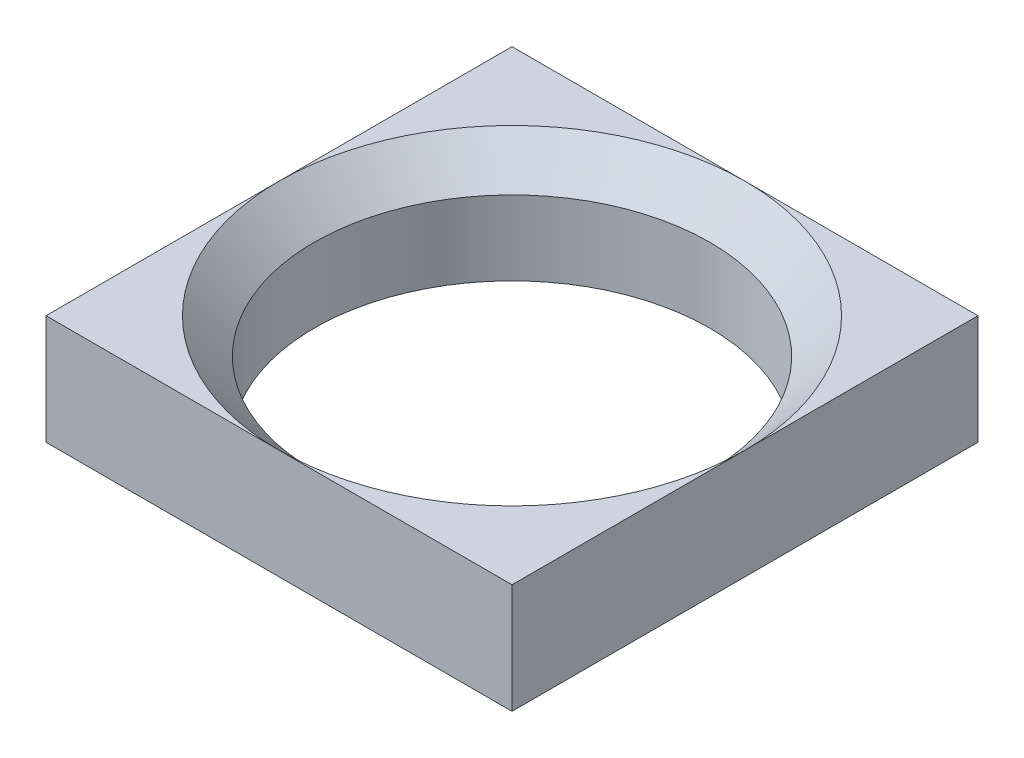
ISO-10303-21;
HEADER;
FILE_DESCRIPTION(('STEP AP214'),'2;1');
FILE_NAME('part.step','',(''),(''),'','','');
FILE_SCHEMA(('AUTOMOTIVE_DESIGN { 1 0 10303 214 1 1 1 1 }'));
ENDSEC;
DATA;
#1=APPLICATION_CONTEXT('core data for automotive mechanical design processes');
#2=APPLICATION_PROTOCOL_DEFINITION('international standard','automotive_design',2000,#1);
#3=PRODUCT_CONTEXT('',#1,'mechanical');
#4=PRODUCT('Part','Part','',(#3));
#5=PRODUCT_RELATED_PRODUCT_CATEGORY('part','',(#4));
#6=PRODUCT_DEFINITION_FORMATION('','',#4);
#7=PRODUCT_DEFINITION_CONTEXT('part definition',#1,'design');
#8=PRODUCT_DEFINITION('design','',#6,#7);
#9=PRODUCT_DEFINITION_SHAPE('','',#8);
#10=(LENGTH_UNIT() NAMED_UNIT(*) SI_UNIT(.MILLI.,.METRE.));
#11=(NAMED_UNIT(*) PLANE_ANGLE_UNIT() SI_UNIT($,.RADIAN.));
#12=(NAMED_UNIT(*) SI_UNIT($,.STERADIAN.) SOLID_ANGLE_UNIT());
#13=UNCERTAINTY_MEASURE_WITH_UNIT(LENGTH_MEASURE(1.E-05),#10,'distance_accuracy_value','');
#14=(GEOMETRIC_REPRESENTATION_CONTEXT(3) GLOBAL_UNCERTAINTY_ASSIGNED_CONTEXT((#13)) GLOBAL_UNIT_ASSIGNED_CONTEXT((#10,
#11,#12)) REPRESENTATION_CONTEXT('',''));
#15=CARTESIAN_POINT('',(0.,0.,0.));
#16=DIRECTION('',(0.,0.,1.));
#17=DIRECTION('',(1.,0.,0.));
#18=AXIS2_PLACEMENT_3D('',#15,#16,#17);
#19=CARTESIAN_POINT('',(0.,2.8,0.));
#20=DIRECTION('',(0.,1.,0.));
#21=DIRECTION('',(0.,0.,1.));
#22=AXIS2_PLACEMENT_3D('',#19,#20,#21);
#23=PLANE('',#22);
#24=DIRECTION('',(1.,0.,0.));
#25=VECTOR('',#24,1.);
#26=CARTESIAN_POINT('',(-5.95,2.8,5.95));
#27=LINE('',#26,#25);
#28=CARTESIAN_POINT('',(-5.95,2.8,5.95));
#29=VERTEX_POINT('',#28);
#30=CARTESIAN_POINT('',(0.,2.8,5.95));
#31=VERTEX_POINT('',#30);
#32=EDGE_CURVE('E139',#29,#31,#27,.T.);
#33=ORIENTED_EDGE('',*,*,#32,.T.);
#34=CARTESIAN_POINT('',(0.,2.8,0.));
#35=DIRECTION('',(0.,1.,0.));
#36=DIRECTION('',(0.,0.,1.));
#37=AXIS2_PLACEMENT_3D('',#34,#35,#36);
#38=CIRCLE('',#37,5.95000000000001);
#39=CARTESIAN_POINT('',(-5.95,2.8,0.));
#40=VERTEX_POINT('',#39);
#41=EDGE_CURVE('E11',#31,#40,#38,.F.);
#42=ORIENTED_EDGE('',*,*,#41,.T.);
#43=DIRECTION('',(0.,0.,1.));
#44=VECTOR('',#43,1.);
#45=CARTESIAN_POINT('',(-5.95,2.8,-5.95));
#46=LINE('',#45,#44);
#47=EDGE_CURVE('E113',#40,#29,#46,.T.);
#48=ORIENTED_EDGE('',*,*,#47,.T.);
#49=EDGE_LOOP('',(#33,#42,#48));
#50=FACE_BOUND('',#49,.T.);
#51=ADVANCED_FACE('F40',(#50),#23,.T.);
#52=CARTESIAN_POINT('',(-5.95,2.8,-5.95));
#53=VERTEX_POINT('',#52);
#54=EDGE_CURVE('E134',#53,#40,#46,.T.);
#55=ORIENTED_EDGE('',*,*,#54,.T.);
#56=CARTESIAN_POINT('',(0.,2.8,0.));
#57=DIRECTION('',(0.,1.,0.));
#58=DIRECTION('',(0.,0.,1.));
#59=AXIS2_PLACEMENT_3D('',#56,#57,#58);
#60=CIRCLE('',#59,5.95000000000001);
#61=CARTESIAN_POINT('',(0.,2.8,-5.95));
#62=VERTEX_POINT('',#61);
#63=EDGE_CURVE('E49',#40,#62,#60,.F.);
#64=ORIENTED_EDGE('',*,*,#63,.T.);
#65=DIRECTION('',(-1.,0.,0.));
#66=VECTOR('',#65,1.);
#67=CARTESIAN_POINT('',(-5.95,2.8,-5.95));
#68=LINE('',#67,#66);
#69=EDGE_CURVE('E112',#62,#53,#68,.T.);
#70=ORIENTED_EDGE('',*,*,#69,.T.);
#71=EDGE_LOOP('',(#55,#64,#70));
#72=FACE_BOUND('',#71,.T.);
#73=ADVANCED_FACE('F132',(#72),#23,.T.);
#74=CARTESIAN_POINT('',(5.95,2.8,-5.95));
#75=VERTEX_POINT('',#74);
#76=EDGE_CURVE('E97',#75,#62,#68,.T.);
#77=ORIENTED_EDGE('',*,*,#76,.T.);
#78=CARTESIAN_POINT('',(0.,2.8,0.));
#79=DIRECTION('',(0.,1.,0.));
#80=DIRECTION('',(0.,0.,1.));
#81=AXIS2_PLACEMENT_3D('',#78,#79,#80);
#82=CIRCLE('',#81,5.95000000000001);
#83=CARTESIAN_POINT('',(5.95,2.8,0.));
#84=VERTEX_POINT('',#83);
#85=EDGE_CURVE('E98',#62,#84,#82,.F.);
#86=ORIENTED_EDGE('',*,*,#85,.T.);
#87=DIRECTION('',(0.,0.,-1.));
#88=VECTOR('',#87,1.);
#89=CARTESIAN_POINT('',(5.95,2.8,-5.95));
#90=LINE('',#89,#88);
#91=EDGE_CURVE('E94',#84,#75,#90,.T.);
#92=ORIENTED_EDGE('',*,*,#91,.T.);
#93=EDGE_LOOP('',(#77,#86,#92));
#94=FACE_BOUND('',#93,.T.);
#95=ADVANCED_FACE('F96',(#94),#23,.T.);
#96=CARTESIAN_POINT('',(5.95,2.8,5.95));
#97=VERTEX_POINT('',#96);
#98=EDGE_CURVE('E102',#97,#84,#90,.T.);
#99=ORIENTED_EDGE('',*,*,#98,.T.);
#100=CARTESIAN_POINT('',(0.,2.8,0.));
#101=DIRECTION('',(0.,1.,0.));
#102=DIRECTION('',(0.,0.,1.));
#103=AXIS2_PLACEMENT_3D('',#100,#101,#102);
#104=CIRCLE('',#103,5.95000000000001);
#105=EDGE_CURVE('E56',#84,#31,#104,.F.);
#106=ORIENTED_EDGE('',*,*,#105,.T.);
#107=EDGE_CURVE('E137',#31,#97,#27,.T.);
#108=ORIENTED_EDGE('',*,*,#107,.T.);
#109=EDGE_LOOP('',(#99,#106,#108));
#110=FACE_BOUND('',#109,.T.);
#111=ADVANCED_FACE('F175',(#110),#23,.T.);
#112=CARTESIAN_POINT('',(0.,0.,0.));
#113=DIRECTION('',(0.,1.,0.));
#114=DIRECTION('',(0.,0.,1.));
#115=AXIS2_PLACEMENT_3D('',#112,#113,#114);
#116=PLANE('',#115);
#117=DIRECTION('',(0.,0.,-1.));
#118=VECTOR('',#117,1.);
#119=CARTESIAN_POINT('',(5.95,0.,-5.95));
#120=LINE('',#119,#118);
#121=CARTESIAN_POINT('',(5.95,0.,5.95));
#122=VERTEX_POINT('',#121);
#123=CARTESIAN_POINT('',(5.95,0.,-5.95));
#124=VERTEX_POINT('',#123);
#125=EDGE_CURVE('E118',#122,#124,#120,.T.);
#126=ORIENTED_EDGE('',*,*,#125,.F.);
#127=DIRECTION('',(1.,0.,0.));
#128=VECTOR('',#127,1.);
#129=CARTESIAN_POINT('',(-5.95,0.,5.95));
#130=LINE('',#129,#128);
#131=CARTESIAN_POINT('',(-5.95,0.,5.95));
#132=VERTEX_POINT('',#131);
#133=EDGE_CURVE('E103',#132,#122,#130,.T.);
#134=ORIENTED_EDGE('',*,*,#133,.F.);
#135=DIRECTION('',(0.,0.,1.));
#136=VECTOR('',#135,1.);
#137=CARTESIAN_POINT('',(-5.95,0.,-5.95));
#138=LINE('',#137,#136);
#139=CARTESIAN_POINT('',(-5.95,0.,-5.95));
#140=VERTEX_POINT('',#139);
#141=EDGE_CURVE('E148',#140,#132,#138,.T.);
#142=ORIENTED_EDGE('',*,*,#141,.F.);
#143=DIRECTION('',(-1.,0.,0.));
#144=VECTOR('',#143,1.);
#145=CARTESIAN_POINT('',(-5.95,0.,-5.95));
#146=LINE('',#145,#144);
#147=EDGE_CURVE('E145',#124,#140,#146,.T.);
#148=ORIENTED_EDGE('',*,*,#147,.F.);
#149=EDGE_LOOP('',(#126,#134,#142,#148));
#150=FACE_BOUND('',#149,.T.);
#151=CARTESIAN_POINT('',(0.,0.,0.));
#152=DIRECTION('',(0.,1.,0.));
#153=DIRECTION('',(0.,0.,1.));
#154=AXIS2_PLACEMENT_3D('',#151,#152,#153);
#155=CIRCLE('',#154,5.05);
#156=CARTESIAN_POINT('',(0.,0.,5.05));
#157=VERTEX_POINT('',#156);
#158=EDGE_CURVE('E146',#157,#157,#155,.T.);
#159=ORIENTED_EDGE('',*,*,#158,.T.);
#160=EDGE_LOOP('',(#159));
#161=FACE_BOUND('',#160,.T.);
#162=ADVANCED_FACE('F160',(#150,#161),#116,.F.);
#163=CARTESIAN_POINT('',(5.95,2.8,-5.95));
#164=DIRECTION('',(-1.,0.,0.));
#165=DIRECTION('',(0.,0.,1.));
#166=AXIS2_PLACEMENT_3D('',#163,#164,#165);
#167=PLANE('',#166);
#168=ORIENTED_EDGE('',*,*,#125,.T.);
#169=DIRECTION('',(0.,-1.,0.));
#170=VECTOR('',#169,1.);
#171=CARTESIAN_POINT('',(5.95,2.8,-5.95));
#172=LINE('',#171,#170);
#173=EDGE_CURVE('E109',#75,#124,#172,.T.);
#174=ORIENTED_EDGE('',*,*,#173,.F.);
#175=ORIENTED_EDGE('',*,*,#91,.F.);
#176=ORIENTED_EDGE('',*,*,#98,.F.);
#177=DIRECTION('',(0.,-1.,0.));
#178=VECTOR('',#177,1.);
#179=CARTESIAN_POINT('',(5.95,2.8,5.95));
#180=LINE('',#179,#178);
#181=EDGE_CURVE('E143',#97,#122,#180,.T.);
#182=ORIENTED_EDGE('',*,*,#181,.T.);
#183=EDGE_LOOP('',(#168,#174,#175,#176,#182));
#184=FACE_BOUND('',#183,.T.);
#185=ADVANCED_FACE('F115',(#184),#167,.F.);
#186=CARTESIAN_POINT('',(-5.95,2.8,-5.95));
#187=DIRECTION('',(0.,0.,1.));
#188=DIRECTION('',(1.,0.,0.));
#189=AXIS2_PLACEMENT_3D('',#186,#187,#188);
#190=PLANE('',#189);
#191=ORIENTED_EDGE('',*,*,#147,.T.);
#192=DIRECTION('',(0.,-1.,0.));
#193=VECTOR('',#192,1.);
#194=CARTESIAN_POINT('',(-5.95,2.8,-5.95));
#195=LINE('',#194,#193);
#196=EDGE_CURVE('E120',#53,#140,#195,.T.);
#197=ORIENTED_EDGE('',*,*,#196,.F.);
#198=ORIENTED_EDGE('',*,*,#69,.F.);
#199=ORIENTED_EDGE('',*,*,#76,.F.);
#200=ORIENTED_EDGE('',*,*,#173,.T.);
#201=EDGE_LOOP('',(#191,#197,#198,#199,#200));
#202=FACE_BOUND('',#201,.T.);
#203=ADVANCED_FACE('F108',(#202),#190,.F.);
#204=CARTESIAN_POINT('',(-5.95,2.8,-5.95));
#205=DIRECTION('',(1.,0.,0.));
#206=DIRECTION('',(0.,0.,-1.));
#207=AXIS2_PLACEMENT_3D('',#204,#205,#206);
#208=PLANE('',#207);
#209=ORIENTED_EDGE('',*,*,#141,.T.);
#210=DIRECTION('',(0.,-1.,0.));
#211=VECTOR('',#210,1.);
#212=CARTESIAN_POINT('',(-5.95,2.8,5.95));
#213=LINE('',#212,#211);
#214=EDGE_CURVE('E125',#29,#132,#213,.T.);
#215=ORIENTED_EDGE('',*,*,#214,.F.);
#216=ORIENTED_EDGE('',*,*,#47,.F.);
#217=ORIENTED_EDGE('',*,*,#54,.F.);
#218=ORIENTED_EDGE('',*,*,#196,.T.);
#219=EDGE_LOOP('',(#209,#215,#216,#217,#218));
#220=FACE_BOUND('',#219,.T.);
#221=ADVANCED_FACE('F162',(#220),#208,.F.);
#222=CARTESIAN_POINT('',(-5.95,2.8,5.95));
#223=DIRECTION('',(0.,0.,-1.));
#224=DIRECTION('',(-1.,0.,0.));
#225=AXIS2_PLACEMENT_3D('',#222,#223,#224);
#226=PLANE('',#225);
#227=ORIENTED_EDGE('',*,*,#133,.T.);
#228=ORIENTED_EDGE('',*,*,#181,.F.);
#229=ORIENTED_EDGE('',*,*,#107,.F.);
#230=ORIENTED_EDGE('',*,*,#32,.F.);
#231=ORIENTED_EDGE('',*,*,#214,.T.);
#232=EDGE_LOOP('',(#227,#228,#229,#230,#231));
#233=FACE_BOUND('',#232,.T.);
#234=ADVANCED_FACE('F156',(#233),#226,.F.);
#235=CARTESIAN_POINT('',(0.,2.8,0.));
#236=DIRECTION('',(0.,-1.,0.));
#237=DIRECTION('',(0.,0.,-1.));
#238=AXIS2_PLACEMENT_3D('',#235,#236,#237);
#239=CYLINDRICAL_SURFACE('',#238,5.05);
#240=CARTESIAN_POINT('',(0.,1.9,0.));
#241=DIRECTION('',(0.,1.,0.));
#242=DIRECTION('',(0.,0.,1.));
#243=AXIS2_PLACEMENT_3D('',#240,#241,#242);
#244=CIRCLE('',#243,5.05);
#245=CARTESIAN_POINT('',(0.,1.9,5.05));
#246=VERTEX_POINT('',#245);
#247=EDGE_CURVE('E119',#246,#246,#244,.T.);
#248=ORIENTED_EDGE('',*,*,#247,.T.);
#249=EDGE_LOOP('',(#248));
#250=FACE_BOUND('',#249,.T.);
#251=ORIENTED_EDGE('',*,*,#158,.F.);
#252=EDGE_LOOP('',(#251));
#253=FACE_BOUND('',#252,.T.);
#254=ADVANCED_FACE('F169',(#250,#253),#239,.F.);
#255=CARTESIAN_POINT('',(0.,1.9,0.));
#256=DIRECTION('',(0.,1.,0.));
#257=DIRECTION('',(0.,0.,1.));
#258=AXIS2_PLACEMENT_3D('',#255,#256,#257);
#259=CONICAL_SURFACE('',#258,5.05,0.785398163397449);
#260=ORIENTED_EDGE('',*,*,#63,.F.);
#261=ORIENTED_EDGE('',*,*,#41,.F.);
#262=ORIENTED_EDGE('',*,*,#105,.F.);
#263=ORIENTED_EDGE('',*,*,#85,.F.);
#264=EDGE_LOOP('',(#260,#261,#262,#263));
#265=FACE_BOUND('',#264,.T.);
#266=ORIENTED_EDGE('',*,*,#247,.F.);
#267=EDGE_LOOP('',(#266));
#268=FACE_BOUND('',#267,.T.);
#269=ADVANCED_FACE('F43',(#265,#268),#259,.F.);
#270=CLOSED_SHELL('',(#51,#73,#95,#111,#162,#185,#203,#221,#234,#254,#269));
#271=MANIFOLD_SOLID_BREP('B2',#270);
#272=ADVANCED_BREP_SHAPE_REPRESENTATION('',(#18,#271),#14);
#273=SHAPE_DEFINITION_REPRESENTATION(#9,#272);
ENDSEC;
END-ISO-10303-21;
